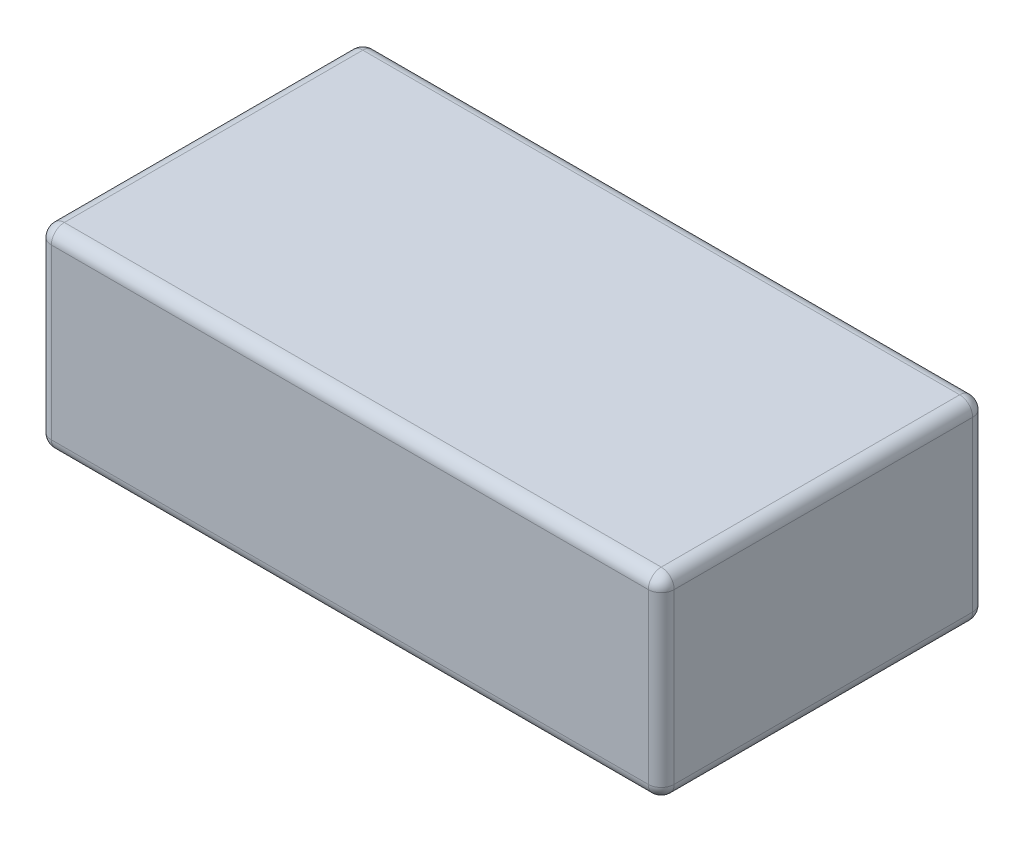
ISO-10303-21;
HEADER;
FILE_DESCRIPTION(('STEP AP214'),'2;1');
FILE_NAME('part.step','',(''),(''),'','','');
FILE_SCHEMA(('AUTOMOTIVE_DESIGN { 1 0 10303 214 1 1 1 1 }'));
ENDSEC;
DATA;
#1=APPLICATION_CONTEXT('core data for automotive mechanical design processes');
#2=APPLICATION_PROTOCOL_DEFINITION('international standard','automotive_design',2000,#1);
#3=PRODUCT_CONTEXT('',#1,'mechanical');
#4=PRODUCT('Part','Part','',(#3));
#5=PRODUCT_RELATED_PRODUCT_CATEGORY('part','',(#4));
#6=PRODUCT_DEFINITION_FORMATION('','',#4);
#7=PRODUCT_DEFINITION_CONTEXT('part definition',#1,'design');
#8=PRODUCT_DEFINITION('design','',#6,#7);
#9=PRODUCT_DEFINITION_SHAPE('','',#8);
#10=(LENGTH_UNIT() NAMED_UNIT(*) SI_UNIT(.MILLI.,.METRE.));
#11=(NAMED_UNIT(*) PLANE_ANGLE_UNIT() SI_UNIT($,.RADIAN.));
#12=(NAMED_UNIT(*) SI_UNIT($,.STERADIAN.) SOLID_ANGLE_UNIT());
#13=UNCERTAINTY_MEASURE_WITH_UNIT(LENGTH_MEASURE(1.E-05),#10,'distance_accuracy_value','');
#14=(GEOMETRIC_REPRESENTATION_CONTEXT(3) GLOBAL_UNCERTAINTY_ASSIGNED_CONTEXT((#13)) GLOBAL_UNIT_ASSIGNED_CONTEXT((#10,
#11,#12)) REPRESENTATION_CONTEXT('',''));
#15=CARTESIAN_POINT('',(0.,0.,0.));
#16=DIRECTION('',(0.,0.,1.));
#17=DIRECTION('',(1.,0.,0.));
#18=AXIS2_PLACEMENT_3D('',#15,#16,#17);
#19=CARTESIAN_POINT('',(24.,15.,12.5));
#20=DIRECTION('',(-1.,0.,0.));
#21=DIRECTION('',(0.,0.,1.));
#22=AXIS2_PLACEMENT_3D('',#19,#20,#21);
#23=PLANE('',#22);
#24=DIRECTION('',(0.,0.,-1.));
#25=VECTOR('',#24,1.);
#26=CARTESIAN_POINT('',(24.,14.,12.5));
#27=LINE('',#26,#25);
#28=CARTESIAN_POINT('',(24.,14.,-11.5));
#29=VERTEX_POINT('',#28);
#30=CARTESIAN_POINT('',(24.,14.,11.5));
#31=VERTEX_POINT('',#30);
#32=EDGE_CURVE('E159',#29,#31,#27,.F.);
#33=ORIENTED_EDGE('',*,*,#32,.T.);
#34=DIRECTION('',(0.,-1.,0.));
#35=VECTOR('',#34,1.);
#36=CARTESIAN_POINT('',(24.,15.,11.5));
#37=LINE('',#36,#35);
#38=CARTESIAN_POINT('',(24.,1.,11.5));
#39=VERTEX_POINT('',#38);
#40=EDGE_CURVE('E162',#31,#39,#37,.T.);
#41=ORIENTED_EDGE('',*,*,#40,.T.);
#42=DIRECTION('',(0.,0.,-1.));
#43=VECTOR('',#42,1.);
#44=CARTESIAN_POINT('',(24.,1.,-12.5));
#45=LINE('',#44,#43);
#46=CARTESIAN_POINT('',(24.,1.,-11.5));
#47=VERTEX_POINT('',#46);
#48=EDGE_CURVE('E136',#39,#47,#45,.T.);
#49=ORIENTED_EDGE('',*,*,#48,.T.);
#50=DIRECTION('',(0.,-1.,0.));
#51=VECTOR('',#50,1.);
#52=CARTESIAN_POINT('',(24.,15.,-11.5));
#53=LINE('',#52,#51);
#54=EDGE_CURVE('E154',#47,#29,#53,.F.);
#55=ORIENTED_EDGE('',*,*,#54,.T.);
#56=EDGE_LOOP('',(#33,#41,#49,#55));
#57=FACE_BOUND('',#56,.T.);
#58=ADVANCED_FACE('F39',(#57),#23,.F.);
#59=CARTESIAN_POINT('',(-24.,15.,-12.5));
#60=DIRECTION('',(0.,0.,1.));
#61=DIRECTION('',(1.,0.,0.));
#62=AXIS2_PLACEMENT_3D('',#59,#60,#61);
#63=PLANE('',#62);
#64=DIRECTION('',(-1.,0.,0.));
#65=VECTOR('',#64,1.);
#66=CARTESIAN_POINT('',(-24.,14.,-12.5));
#67=LINE('',#66,#65);
#68=CARTESIAN_POINT('',(-23.,14.,-12.5));
#69=VERTEX_POINT('',#68);
#70=CARTESIAN_POINT('',(23.,14.,-12.5));
#71=VERTEX_POINT('',#70);
#72=EDGE_CURVE('E177',#69,#71,#67,.F.);
#73=ORIENTED_EDGE('',*,*,#72,.T.);
#74=DIRECTION('',(0.,-1.,0.));
#75=VECTOR('',#74,1.);
#76=CARTESIAN_POINT('',(23.,15.,-12.5));
#77=LINE('',#76,#75);
#78=CARTESIAN_POINT('',(23.,1.,-12.5));
#79=VERTEX_POINT('',#78);
#80=EDGE_CURVE('E182',#71,#79,#77,.T.);
#81=ORIENTED_EDGE('',*,*,#80,.T.);
#82=DIRECTION('',(-1.,0.,0.));
#83=VECTOR('',#82,1.);
#84=CARTESIAN_POINT('',(-24.,1.,-12.5));
#85=LINE('',#84,#83);
#86=CARTESIAN_POINT('',(-23.,1.,-12.5));
#87=VERTEX_POINT('',#86);
#88=EDGE_CURVE('E179',#79,#87,#85,.T.);
#89=ORIENTED_EDGE('',*,*,#88,.T.);
#90=DIRECTION('',(0.,-1.,0.));
#91=VECTOR('',#90,1.);
#92=CARTESIAN_POINT('',(-23.,15.,-12.5));
#93=LINE('',#92,#91);
#94=EDGE_CURVE('E175',#87,#69,#93,.F.);
#95=ORIENTED_EDGE('',*,*,#94,.T.);
#96=EDGE_LOOP('',(#73,#81,#89,#95));
#97=FACE_BOUND('',#96,.T.);
#98=ADVANCED_FACE('F329',(#97),#63,.F.);
#99=CARTESIAN_POINT('',(-24.,15.,12.5));
#100=DIRECTION('',(1.,0.,0.));
#101=DIRECTION('',(0.,0.,-1.));
#102=AXIS2_PLACEMENT_3D('',#99,#100,#101);
#103=PLANE('',#102);
#104=DIRECTION('',(0.,0.,1.));
#105=VECTOR('',#104,1.);
#106=CARTESIAN_POINT('',(-24.,1.,12.5));
#107=LINE('',#106,#105);
#108=CARTESIAN_POINT('',(-24.,1.,-11.5));
#109=VERTEX_POINT('',#108);
#110=CARTESIAN_POINT('',(-24.,1.,11.5));
#111=VERTEX_POINT('',#110);
#112=EDGE_CURVE('E188',#109,#111,#107,.T.);
#113=ORIENTED_EDGE('',*,*,#112,.T.);
#114=DIRECTION('',(0.,-1.,0.));
#115=VECTOR('',#114,1.);
#116=CARTESIAN_POINT('',(-24.,15.,11.5));
#117=LINE('',#116,#115);
#118=CARTESIAN_POINT('',(-24.,14.,11.5));
#119=VERTEX_POINT('',#118);
#120=EDGE_CURVE('E191',#111,#119,#117,.F.);
#121=ORIENTED_EDGE('',*,*,#120,.T.);
#122=DIRECTION('',(0.,0.,1.));
#123=VECTOR('',#122,1.);
#124=CARTESIAN_POINT('',(-24.,14.,12.5));
#125=LINE('',#124,#123);
#126=CARTESIAN_POINT('',(-24.,14.,-11.5));
#127=VERTEX_POINT('',#126);
#128=EDGE_CURVE('E186',#119,#127,#125,.F.);
#129=ORIENTED_EDGE('',*,*,#128,.T.);
#130=DIRECTION('',(0.,-1.,0.));
#131=VECTOR('',#130,1.);
#132=CARTESIAN_POINT('',(-24.,15.,-11.5));
#133=LINE('',#132,#131);
#134=EDGE_CURVE('E184',#127,#109,#133,.T.);
#135=ORIENTED_EDGE('',*,*,#134,.T.);
#136=EDGE_LOOP('',(#113,#121,#129,#135));
#137=FACE_BOUND('',#136,.T.);
#138=ADVANCED_FACE('F299',(#137),#103,.F.);
#139=CARTESIAN_POINT('',(-24.,15.,12.5));
#140=DIRECTION('',(0.,0.,-1.));
#141=DIRECTION('',(-1.,0.,0.));
#142=AXIS2_PLACEMENT_3D('',#139,#140,#141);
#143=PLANE('',#142);
#144=DIRECTION('',(1.,0.,0.));
#145=VECTOR('',#144,1.);
#146=CARTESIAN_POINT('',(24.,1.,12.5));
#147=LINE('',#146,#145);
#148=CARTESIAN_POINT('',(-23.,1.,12.5));
#149=VERTEX_POINT('',#148);
#150=CARTESIAN_POINT('',(23.,1.,12.5));
#151=VERTEX_POINT('',#150);
#152=EDGE_CURVE('E197',#149,#151,#147,.T.);
#153=ORIENTED_EDGE('',*,*,#152,.T.);
#154=DIRECTION('',(0.,-1.,0.));
#155=VECTOR('',#154,1.);
#156=CARTESIAN_POINT('',(23.,15.,12.5));
#157=LINE('',#156,#155);
#158=CARTESIAN_POINT('',(23.,14.,12.5));
#159=VERTEX_POINT('',#158);
#160=EDGE_CURVE('E200',#151,#159,#157,.F.);
#161=ORIENTED_EDGE('',*,*,#160,.T.);
#162=DIRECTION('',(1.,0.,0.));
#163=VECTOR('',#162,1.);
#164=CARTESIAN_POINT('',(-24.,14.,12.5));
#165=LINE('',#164,#163);
#166=CARTESIAN_POINT('',(-23.,14.,12.5));
#167=VERTEX_POINT('',#166);
#168=EDGE_CURVE('E195',#159,#167,#165,.F.);
#169=ORIENTED_EDGE('',*,*,#168,.T.);
#170=DIRECTION('',(0.,-1.,0.));
#171=VECTOR('',#170,1.);
#172=CARTESIAN_POINT('',(-23.,15.,12.5));
#173=LINE('',#172,#171);
#174=EDGE_CURVE('E193',#167,#149,#173,.T.);
#175=ORIENTED_EDGE('',*,*,#174,.T.);
#176=EDGE_LOOP('',(#153,#161,#169,#175));
#177=FACE_BOUND('',#176,.T.);
#178=ADVANCED_FACE('F275',(#177),#143,.F.);
#179=CARTESIAN_POINT('',(0.,15.,0.));
#180=DIRECTION('',(0.,-1.,0.));
#181=DIRECTION('',(0.,0.,-1.));
#182=AXIS2_PLACEMENT_3D('',#179,#180,#181);
#183=PLANE('',#182);
#184=DIRECTION('',(1.,0.,0.));
#185=VECTOR('',#184,1.);
#186=CARTESIAN_POINT('',(0.,15.,11.5));
#187=LINE('',#186,#185);
#188=CARTESIAN_POINT('',(-23.,15.,11.5));
#189=VERTEX_POINT('',#188);
#190=CARTESIAN_POINT('',(23.,15.,11.5));
#191=VERTEX_POINT('',#190);
#192=EDGE_CURVE('E202',#189,#191,#187,.T.);
#193=ORIENTED_EDGE('',*,*,#192,.T.);
#194=DIRECTION('',(0.,0.,-1.));
#195=VECTOR('',#194,1.);
#196=CARTESIAN_POINT('',(23.,15.,0.));
#197=LINE('',#196,#195);
#198=CARTESIAN_POINT('',(23.,15.,-11.5));
#199=VERTEX_POINT('',#198);
#200=EDGE_CURVE('E11',#191,#199,#197,.T.);
#201=ORIENTED_EDGE('',*,*,#200,.T.);
#202=DIRECTION('',(-1.,0.,0.));
#203=VECTOR('',#202,1.);
#204=CARTESIAN_POINT('',(0.,15.,-11.5));
#205=LINE('',#204,#203);
#206=CARTESIAN_POINT('',(-23.,15.,-11.5));
#207=VERTEX_POINT('',#206);
#208=EDGE_CURVE('E48',#199,#207,#205,.T.);
#209=ORIENTED_EDGE('',*,*,#208,.T.);
#210=DIRECTION('',(0.,0.,1.));
#211=VECTOR('',#210,1.);
#212=CARTESIAN_POINT('',(-23.,15.,0.));
#213=LINE('',#212,#211);
#214=EDGE_CURVE('E204',#207,#189,#213,.T.);
#215=ORIENTED_EDGE('',*,*,#214,.T.);
#216=EDGE_LOOP('',(#193,#201,#209,#215));
#217=FACE_BOUND('',#216,.T.);
#218=ADVANCED_FACE('F283',(#217),#183,.F.);
#219=CARTESIAN_POINT('',(0.,0.,0.));
#220=DIRECTION('',(0.,-1.,0.));
#221=DIRECTION('',(0.,0.,-1.));
#222=AXIS2_PLACEMENT_3D('',#219,#220,#221);
#223=PLANE('',#222);
#224=DIRECTION('',(-1.,0.,0.));
#225=VECTOR('',#224,1.);
#226=CARTESIAN_POINT('',(24.,0.,-11.5));
#227=LINE('',#226,#225);
#228=CARTESIAN_POINT('',(-23.,0.,-11.5));
#229=VERTEX_POINT('',#228);
#230=CARTESIAN_POINT('',(23.,0.,-11.5));
#231=VERTEX_POINT('',#230);
#232=EDGE_CURVE('E172',#229,#231,#227,.F.);
#233=ORIENTED_EDGE('',*,*,#232,.T.);
#234=DIRECTION('',(0.,0.,-1.));
#235=VECTOR('',#234,1.);
#236=CARTESIAN_POINT('',(23.,0.,12.5));
#237=LINE('',#236,#235);
#238=CARTESIAN_POINT('',(23.,0.,11.5));
#239=VERTEX_POINT('',#238);
#240=EDGE_CURVE('E138',#231,#239,#237,.F.);
#241=ORIENTED_EDGE('',*,*,#240,.T.);
#242=DIRECTION('',(1.,0.,0.));
#243=VECTOR('',#242,1.);
#244=CARTESIAN_POINT('',(-24.,0.,11.5));
#245=LINE('',#244,#243);
#246=CARTESIAN_POINT('',(-23.,0.,11.5));
#247=VERTEX_POINT('',#246);
#248=EDGE_CURVE('E165',#239,#247,#245,.F.);
#249=ORIENTED_EDGE('',*,*,#248,.T.);
#250=DIRECTION('',(0.,0.,1.));
#251=VECTOR('',#250,1.);
#252=CARTESIAN_POINT('',(-23.,0.,-12.5));
#253=LINE('',#252,#251);
#254=EDGE_CURVE('E170',#247,#229,#253,.F.);
#255=ORIENTED_EDGE('',*,*,#254,.T.);
#256=EDGE_LOOP('',(#233,#241,#249,#255));
#257=FACE_BOUND('',#256,.T.);
#258=ADVANCED_FACE('F362',(#257),#223,.T.);
#259=CARTESIAN_POINT('',(-23.,14.,0.));
#260=DIRECTION('',(0.,0.,1.));
#261=DIRECTION('',(1.,0.,0.));
#262=AXIS2_PLACEMENT_3D('',#259,#260,#261);
#263=CYLINDRICAL_SURFACE('',#262,1.);
#264=CARTESIAN_POINT('',(-23.,14.,11.5));
#265=DIRECTION('',(0.,0.,1.));
#266=DIRECTION('',(1.,0.,0.));
#267=AXIS2_PLACEMENT_3D('',#264,#265,#266);
#268=CIRCLE('',#267,1.);
#269=EDGE_CURVE('E43',#189,#119,#268,.T.);
#270=ORIENTED_EDGE('',*,*,#269,.F.);
#271=ORIENTED_EDGE('',*,*,#214,.F.);
#272=CARTESIAN_POINT('',(-23.,14.,-11.5));
#273=DIRECTION('',(0.,0.,-1.));
#274=DIRECTION('',(-1.,0.,0.));
#275=AXIS2_PLACEMENT_3D('',#272,#273,#274);
#276=CIRCLE('',#275,1.);
#277=EDGE_CURVE('E253',#127,#207,#276,.T.);
#278=ORIENTED_EDGE('',*,*,#277,.F.);
#279=ORIENTED_EDGE('',*,*,#128,.F.);
#280=EDGE_LOOP('',(#270,#271,#278,#279));
#281=FACE_BOUND('',#280,.T.);
#282=ADVANCED_FACE('F41',(#281),#263,.T.);
#283=CARTESIAN_POINT('',(-23.,14.,11.5));
#284=DIRECTION('',(0.,0.,1.));
#285=DIRECTION('',(1.,0.,0.));
#286=AXIS2_PLACEMENT_3D('',#283,#284,#285);
#287=SPHERICAL_SURFACE('',#286,1.);
#288=CARTESIAN_POINT('',(-23.,14.,11.5));
#289=DIRECTION('',(-1.,0.,0.));
#290=DIRECTION('',(0.,0.,1.));
#291=AXIS2_PLACEMENT_3D('',#288,#289,#290);
#292=CIRCLE('',#291,1.);
#293=EDGE_CURVE('E248',#189,#167,#292,.F.);
#294=ORIENTED_EDGE('',*,*,#293,.F.);
#295=ORIENTED_EDGE('',*,*,#269,.T.);
#296=CARTESIAN_POINT('',(-23.,14.,11.5));
#297=DIRECTION('',(0.,1.,0.));
#298=DIRECTION('',(0.,0.,1.));
#299=AXIS2_PLACEMENT_3D('',#296,#297,#298);
#300=CIRCLE('',#299,1.);
#301=EDGE_CURVE('E251',#167,#119,#300,.F.);
#302=ORIENTED_EDGE('',*,*,#301,.F.);
#303=EDGE_LOOP('',(#294,#295,#302));
#304=FACE_BOUND('',#303,.T.);
#305=ADVANCED_FACE('F264',(#304),#287,.T.);
#306=CARTESIAN_POINT('',(-23.,14.,-11.5));
#307=DIRECTION('',(0.,0.,1.));
#308=DIRECTION('',(1.,0.,0.));
#309=AXIS2_PLACEMENT_3D('',#306,#307,#308);
#310=SPHERICAL_SURFACE('',#309,1.);
#311=CARTESIAN_POINT('',(-23.,14.,-11.5));
#312=DIRECTION('',(0.,1.,0.));
#313=DIRECTION('',(0.,0.,1.));
#314=AXIS2_PLACEMENT_3D('',#311,#312,#313);
#315=CIRCLE('',#314,1.);
#316=EDGE_CURVE('E242',#127,#69,#315,.F.);
#317=ORIENTED_EDGE('',*,*,#316,.F.);
#318=ORIENTED_EDGE('',*,*,#277,.T.);
#319=CARTESIAN_POINT('',(-23.,14.,-11.5));
#320=DIRECTION('',(-1.,0.,0.));
#321=DIRECTION('',(0.,0.,1.));
#322=AXIS2_PLACEMENT_3D('',#319,#320,#321);
#323=CIRCLE('',#322,1.);
#324=EDGE_CURVE('E245',#69,#207,#323,.F.);
#325=ORIENTED_EDGE('',*,*,#324,.F.);
#326=EDGE_LOOP('',(#317,#318,#325));
#327=FACE_BOUND('',#326,.T.);
#328=ADVANCED_FACE('F291',(#327),#310,.T.);
#329=CARTESIAN_POINT('',(-23.,15.,11.5));
#330=DIRECTION('',(0.,-1.,0.));
#331=DIRECTION('',(0.,0.,-1.));
#332=AXIS2_PLACEMENT_3D('',#329,#330,#331);
#333=CYLINDRICAL_SURFACE('',#332,1.);
#334=ORIENTED_EDGE('',*,*,#301,.T.);
#335=ORIENTED_EDGE('',*,*,#120,.F.);
#336=CARTESIAN_POINT('',(-23.,1.,11.5));
#337=DIRECTION('',(0.,-1.,0.));
#338=DIRECTION('',(0.,0.,-1.));
#339=AXIS2_PLACEMENT_3D('',#336,#337,#338);
#340=CIRCLE('',#339,1.);
#341=EDGE_CURVE('E237',#149,#111,#340,.T.);
#342=ORIENTED_EDGE('',*,*,#341,.F.);
#343=ORIENTED_EDGE('',*,*,#174,.F.);
#344=EDGE_LOOP('',(#334,#335,#342,#343));
#345=FACE_BOUND('',#344,.T.);
#346=ADVANCED_FACE('F271',(#345),#333,.T.);
#347=CARTESIAN_POINT('',(0.,14.,11.5));
#348=DIRECTION('',(1.,0.,0.));
#349=DIRECTION('',(0.,0.,-1.));
#350=AXIS2_PLACEMENT_3D('',#347,#348,#349);
#351=CYLINDRICAL_SURFACE('',#350,1.);
#352=ORIENTED_EDGE('',*,*,#293,.T.);
#353=ORIENTED_EDGE('',*,*,#168,.F.);
#354=CARTESIAN_POINT('',(23.,14.,11.5));
#355=DIRECTION('',(1.,0.,0.));
#356=DIRECTION('',(0.,0.,-1.));
#357=AXIS2_PLACEMENT_3D('',#354,#355,#356);
#358=CIRCLE('',#357,1.);
#359=EDGE_CURVE('E234',#191,#159,#358,.T.);
#360=ORIENTED_EDGE('',*,*,#359,.F.);
#361=ORIENTED_EDGE('',*,*,#192,.F.);
#362=EDGE_LOOP('',(#352,#353,#360,#361));
#363=FACE_BOUND('',#362,.T.);
#364=ADVANCED_FACE('F281',(#363),#351,.T.);
#365=CARTESIAN_POINT('',(23.,14.,0.));
#366=DIRECTION('',(0.,0.,-1.));
#367=DIRECTION('',(-1.,0.,0.));
#368=AXIS2_PLACEMENT_3D('',#365,#366,#367);
#369=CYLINDRICAL_SURFACE('',#368,1.);
#370=CARTESIAN_POINT('',(23.,14.,-11.5));
#371=DIRECTION('',(0.,0.,-1.));
#372=DIRECTION('',(-1.,0.,0.));
#373=AXIS2_PLACEMENT_3D('',#370,#371,#372);
#374=CIRCLE('',#373,1.);
#375=EDGE_CURVE('E229',#199,#29,#374,.T.);
#376=ORIENTED_EDGE('',*,*,#375,.F.);
#377=ORIENTED_EDGE('',*,*,#200,.F.);
#378=CARTESIAN_POINT('',(23.,14.,11.5));
#379=DIRECTION('',(0.,0.,1.));
#380=DIRECTION('',(1.,0.,0.));
#381=AXIS2_PLACEMENT_3D('',#378,#379,#380);
#382=CIRCLE('',#381,1.);
#383=EDGE_CURVE('E231',#31,#191,#382,.T.);
#384=ORIENTED_EDGE('',*,*,#383,.F.);
#385=ORIENTED_EDGE('',*,*,#32,.F.);
#386=EDGE_LOOP('',(#376,#377,#384,#385));
#387=FACE_BOUND('',#386,.T.);
#388=ADVANCED_FACE('F286',(#387),#369,.T.);
#389=CARTESIAN_POINT('',(0.,14.,-11.5));
#390=DIRECTION('',(-1.,0.,0.));
#391=DIRECTION('',(0.,0.,1.));
#392=AXIS2_PLACEMENT_3D('',#389,#390,#391);
#393=CYLINDRICAL_SURFACE('',#392,1.);
#394=ORIENTED_EDGE('',*,*,#324,.T.);
#395=ORIENTED_EDGE('',*,*,#208,.F.);
#396=CARTESIAN_POINT('',(23.,14.,-11.5));
#397=DIRECTION('',(1.,0.,0.));
#398=DIRECTION('',(0.,0.,-1.));
#399=AXIS2_PLACEMENT_3D('',#396,#397,#398);
#400=CIRCLE('',#399,1.);
#401=EDGE_CURVE('E56',#71,#199,#400,.T.);
#402=ORIENTED_EDGE('',*,*,#401,.F.);
#403=ORIENTED_EDGE('',*,*,#72,.F.);
#404=EDGE_LOOP('',(#394,#395,#402,#403));
#405=FACE_BOUND('',#404,.T.);
#406=ADVANCED_FACE('F289',(#405),#393,.T.);
#407=CARTESIAN_POINT('',(-23.,15.,-11.5));
#408=DIRECTION('',(0.,-1.,0.));
#409=DIRECTION('',(0.,0.,-1.));
#410=AXIS2_PLACEMENT_3D('',#407,#408,#409);
#411=CYLINDRICAL_SURFACE('',#410,1.);
#412=ORIENTED_EDGE('',*,*,#316,.T.);
#413=ORIENTED_EDGE('',*,*,#94,.F.);
#414=CARTESIAN_POINT('',(-23.,1.,-11.5));
#415=DIRECTION('',(0.,-1.,0.));
#416=DIRECTION('',(0.,0.,-1.));
#417=AXIS2_PLACEMENT_3D('',#414,#415,#416);
#418=CIRCLE('',#417,1.);
#419=EDGE_CURVE('E225',#109,#87,#418,.T.);
#420=ORIENTED_EDGE('',*,*,#419,.F.);
#421=ORIENTED_EDGE('',*,*,#134,.F.);
#422=EDGE_LOOP('',(#412,#413,#420,#421));
#423=FACE_BOUND('',#422,.T.);
#424=ADVANCED_FACE('F296',(#423),#411,.T.);
#425=CARTESIAN_POINT('',(-23.,1.,12.5));
#426=DIRECTION('',(0.,0.,-1.));
#427=DIRECTION('',(-1.,0.,0.));
#428=AXIS2_PLACEMENT_3D('',#425,#426,#427);
#429=CYLINDRICAL_SURFACE('',#428,1.);
#430=CARTESIAN_POINT('',(-23.,1.,11.5));
#431=DIRECTION('',(0.,0.,1.));
#432=DIRECTION('',(1.,0.,0.));
#433=AXIS2_PLACEMENT_3D('',#430,#431,#432);
#434=CIRCLE('',#433,1.);
#435=EDGE_CURVE('E239',#111,#247,#434,.T.);
#436=ORIENTED_EDGE('',*,*,#435,.F.);
#437=ORIENTED_EDGE('',*,*,#112,.F.);
#438=CARTESIAN_POINT('',(-23.,1.,-11.5));
#439=DIRECTION('',(0.,0.,-1.));
#440=DIRECTION('',(-1.,0.,0.));
#441=AXIS2_PLACEMENT_3D('',#438,#439,#440);
#442=CIRCLE('',#441,1.);
#443=EDGE_CURVE('E222',#229,#109,#442,.T.);
#444=ORIENTED_EDGE('',*,*,#443,.F.);
#445=ORIENTED_EDGE('',*,*,#254,.F.);
#446=EDGE_LOOP('',(#436,#437,#444,#445));
#447=FACE_BOUND('',#446,.T.);
#448=ADVANCED_FACE('F303',(#447),#429,.T.);
#449=CARTESIAN_POINT('',(-23.,1.,11.5));
#450=DIRECTION('',(0.,0.,1.));
#451=DIRECTION('',(1.,0.,0.));
#452=AXIS2_PLACEMENT_3D('',#449,#450,#451);
#453=SPHERICAL_SURFACE('',#452,1.);
#454=ORIENTED_EDGE('',*,*,#341,.T.);
#455=ORIENTED_EDGE('',*,*,#435,.T.);
#456=CARTESIAN_POINT('',(-23.,1.,11.5));
#457=DIRECTION('',(-1.,0.,0.));
#458=DIRECTION('',(0.,0.,1.));
#459=AXIS2_PLACEMENT_3D('',#456,#457,#458);
#460=CIRCLE('',#459,1.);
#461=EDGE_CURVE('E219',#149,#247,#460,.F.);
#462=ORIENTED_EDGE('',*,*,#461,.F.);
#463=EDGE_LOOP('',(#454,#455,#462));
#464=FACE_BOUND('',#463,.T.);
#465=ADVANCED_FACE('F307',(#464),#453,.T.);
#466=CARTESIAN_POINT('',(23.,14.,11.5));
#467=DIRECTION('',(0.,0.,1.));
#468=DIRECTION('',(1.,0.,0.));
#469=AXIS2_PLACEMENT_3D('',#466,#467,#468);
#470=SPHERICAL_SURFACE('',#469,1.);
#471=ORIENTED_EDGE('',*,*,#383,.T.);
#472=ORIENTED_EDGE('',*,*,#359,.T.);
#473=CARTESIAN_POINT('',(23.,14.,11.5));
#474=DIRECTION('',(0.,1.,0.));
#475=DIRECTION('',(0.,0.,1.));
#476=AXIS2_PLACEMENT_3D('',#473,#474,#475);
#477=CIRCLE('',#476,1.);
#478=EDGE_CURVE('E216',#31,#159,#477,.F.);
#479=ORIENTED_EDGE('',*,*,#478,.F.);
#480=EDGE_LOOP('',(#471,#472,#479));
#481=FACE_BOUND('',#480,.T.);
#482=ADVANCED_FACE('F317',(#481),#470,.T.);
#483=CARTESIAN_POINT('',(23.,14.,-11.5));
#484=DIRECTION('',(0.,0.,1.));
#485=DIRECTION('',(1.,0.,0.));
#486=AXIS2_PLACEMENT_3D('',#483,#484,#485);
#487=SPHERICAL_SURFACE('',#486,1.);
#488=ORIENTED_EDGE('',*,*,#401,.T.);
#489=ORIENTED_EDGE('',*,*,#375,.T.);
#490=CARTESIAN_POINT('',(23.,14.,-11.5));
#491=DIRECTION('',(0.,1.,0.));
#492=DIRECTION('',(0.,0.,1.));
#493=AXIS2_PLACEMENT_3D('',#490,#491,#492);
#494=CIRCLE('',#493,1.);
#495=EDGE_CURVE('E156',#71,#29,#494,.F.);
#496=ORIENTED_EDGE('',*,*,#495,.F.);
#497=EDGE_LOOP('',(#488,#489,#496));
#498=FACE_BOUND('',#497,.T.);
#499=ADVANCED_FACE('F319',(#498),#487,.T.);
#500=CARTESIAN_POINT('',(-23.,1.,-11.5));
#501=DIRECTION('',(0.,0.,1.));
#502=DIRECTION('',(1.,0.,0.));
#503=AXIS2_PLACEMENT_3D('',#500,#501,#502);
#504=SPHERICAL_SURFACE('',#503,1.);
#505=ORIENTED_EDGE('',*,*,#443,.T.);
#506=ORIENTED_EDGE('',*,*,#419,.T.);
#507=CARTESIAN_POINT('',(-23.,1.,-11.5));
#508=DIRECTION('',(-1.,0.,0.));
#509=DIRECTION('',(0.,0.,1.));
#510=AXIS2_PLACEMENT_3D('',#507,#508,#509);
#511=CIRCLE('',#510,1.);
#512=EDGE_CURVE('E213',#229,#87,#511,.F.);
#513=ORIENTED_EDGE('',*,*,#512,.F.);
#514=EDGE_LOOP('',(#505,#506,#513));
#515=FACE_BOUND('',#514,.T.);
#516=ADVANCED_FACE('F325',(#515),#504,.T.);
#517=CARTESIAN_POINT('',(-24.,1.,11.5));
#518=DIRECTION('',(-1.,0.,0.));
#519=DIRECTION('',(0.,0.,1.));
#520=AXIS2_PLACEMENT_3D('',#517,#518,#519);
#521=CYLINDRICAL_SURFACE('',#520,1.);
#522=ORIENTED_EDGE('',*,*,#461,.T.);
#523=ORIENTED_EDGE('',*,*,#248,.F.);
#524=CARTESIAN_POINT('',(23.,1.,11.5));
#525=DIRECTION('',(1.,0.,0.));
#526=DIRECTION('',(0.,0.,-1.));
#527=AXIS2_PLACEMENT_3D('',#524,#525,#526);
#528=CIRCLE('',#527,1.);
#529=EDGE_CURVE('E210',#151,#239,#528,.T.);
#530=ORIENTED_EDGE('',*,*,#529,.F.);
#531=ORIENTED_EDGE('',*,*,#152,.F.);
#532=EDGE_LOOP('',(#522,#523,#530,#531));
#533=FACE_BOUND('',#532,.T.);
#534=ADVANCED_FACE('F310',(#533),#521,.T.);
#535=CARTESIAN_POINT('',(23.,15.,11.5));
#536=DIRECTION('',(0.,-1.,0.));
#537=DIRECTION('',(0.,0.,-1.));
#538=AXIS2_PLACEMENT_3D('',#535,#536,#537);
#539=CYLINDRICAL_SURFACE('',#538,1.);
#540=ORIENTED_EDGE('',*,*,#478,.T.);
#541=ORIENTED_EDGE('',*,*,#160,.F.);
#542=CARTESIAN_POINT('',(23.,1.,11.5));
#543=DIRECTION('',(0.,-1.,0.));
#544=DIRECTION('',(0.,0.,-1.));
#545=AXIS2_PLACEMENT_3D('',#542,#543,#544);
#546=CIRCLE('',#545,1.);
#547=EDGE_CURVE('E151',#39,#151,#546,.T.);
#548=ORIENTED_EDGE('',*,*,#547,.F.);
#549=ORIENTED_EDGE('',*,*,#40,.F.);
#550=EDGE_LOOP('',(#540,#541,#548,#549));
#551=FACE_BOUND('',#550,.T.);
#552=ADVANCED_FACE('F315',(#551),#539,.T.);
#553=CARTESIAN_POINT('',(23.,15.,-11.5));
#554=DIRECTION('',(0.,-1.,0.));
#555=DIRECTION('',(0.,0.,-1.));
#556=AXIS2_PLACEMENT_3D('',#553,#554,#555);
#557=CYLINDRICAL_SURFACE('',#556,1.);
#558=ORIENTED_EDGE('',*,*,#495,.T.);
#559=ORIENTED_EDGE('',*,*,#54,.F.);
#560=CARTESIAN_POINT('',(23.,1.,-11.5));
#561=DIRECTION('',(0.,-1.,0.));
#562=DIRECTION('',(0.,0.,-1.));
#563=AXIS2_PLACEMENT_3D('',#560,#561,#562);
#564=CIRCLE('',#563,1.);
#565=EDGE_CURVE('E144',#79,#47,#564,.T.);
#566=ORIENTED_EDGE('',*,*,#565,.F.);
#567=ORIENTED_EDGE('',*,*,#80,.F.);
#568=EDGE_LOOP('',(#558,#559,#566,#567));
#569=FACE_BOUND('',#568,.T.);
#570=ADVANCED_FACE('F155',(#569),#557,.T.);
#571=CARTESIAN_POINT('',(-24.,1.,-11.5));
#572=DIRECTION('',(1.,0.,0.));
#573=DIRECTION('',(0.,0.,-1.));
#574=AXIS2_PLACEMENT_3D('',#571,#572,#573);
#575=CYLINDRICAL_SURFACE('',#574,1.);
#576=ORIENTED_EDGE('',*,*,#512,.T.);
#577=ORIENTED_EDGE('',*,*,#88,.F.);
#578=CARTESIAN_POINT('',(23.,1.,-11.5));
#579=DIRECTION('',(1.,0.,0.));
#580=DIRECTION('',(0.,0.,-1.));
#581=AXIS2_PLACEMENT_3D('',#578,#579,#580);
#582=CIRCLE('',#581,1.);
#583=EDGE_CURVE('E148',#231,#79,#582,.T.);
#584=ORIENTED_EDGE('',*,*,#583,.F.);
#585=ORIENTED_EDGE('',*,*,#232,.F.);
#586=EDGE_LOOP('',(#576,#577,#584,#585));
#587=FACE_BOUND('',#586,.T.);
#588=ADVANCED_FACE('F345',(#587),#575,.T.);
#589=CARTESIAN_POINT('',(23.,1.,11.5));
#590=DIRECTION('',(0.,0.,1.));
#591=DIRECTION('',(1.,0.,0.));
#592=AXIS2_PLACEMENT_3D('',#589,#590,#591);
#593=SPHERICAL_SURFACE('',#592,1.);
#594=ORIENTED_EDGE('',*,*,#547,.T.);
#595=ORIENTED_EDGE('',*,*,#529,.T.);
#596=CARTESIAN_POINT('',(23.,1.,11.5));
#597=DIRECTION('',(0.,0.,1.));
#598=DIRECTION('',(1.,0.,0.));
#599=AXIS2_PLACEMENT_3D('',#596,#597,#598);
#600=CIRCLE('',#599,1.);
#601=EDGE_CURVE('E141',#39,#239,#600,.F.);
#602=ORIENTED_EDGE('',*,*,#601,.F.);
#603=EDGE_LOOP('',(#594,#595,#602));
#604=FACE_BOUND('',#603,.T.);
#605=ADVANCED_FACE('F342',(#604),#593,.T.);
#606=CARTESIAN_POINT('',(23.,1.,-11.5));
#607=DIRECTION('',(0.,0.,1.));
#608=DIRECTION('',(1.,0.,0.));
#609=AXIS2_PLACEMENT_3D('',#606,#607,#608);
#610=SPHERICAL_SURFACE('',#609,1.);
#611=ORIENTED_EDGE('',*,*,#583,.T.);
#612=ORIENTED_EDGE('',*,*,#565,.T.);
#613=CARTESIAN_POINT('',(23.,1.,-11.5));
#614=DIRECTION('',(0.,0.,-1.));
#615=DIRECTION('',(-1.,0.,0.));
#616=AXIS2_PLACEMENT_3D('',#613,#614,#615);
#617=CIRCLE('',#616,1.);
#618=EDGE_CURVE('E132',#231,#47,#617,.F.);
#619=ORIENTED_EDGE('',*,*,#618,.F.);
#620=EDGE_LOOP('',(#611,#612,#619));
#621=FACE_BOUND('',#620,.T.);
#622=ADVANCED_FACE('F146',(#621),#610,.T.);
#623=CARTESIAN_POINT('',(23.,1.,12.5));
#624=DIRECTION('',(0.,0.,1.));
#625=DIRECTION('',(1.,0.,0.));
#626=AXIS2_PLACEMENT_3D('',#623,#624,#625);
#627=CYLINDRICAL_SURFACE('',#626,1.);
#628=ORIENTED_EDGE('',*,*,#601,.T.);
#629=ORIENTED_EDGE('',*,*,#240,.F.);
#630=ORIENTED_EDGE('',*,*,#618,.T.);
#631=ORIENTED_EDGE('',*,*,#48,.F.);
#632=EDGE_LOOP('',(#628,#629,#630,#631));
#633=FACE_BOUND('',#632,.T.);
#634=ADVANCED_FACE('F134',(#633),#627,.T.);
#635=CLOSED_SHELL('',(#58,#98,#138,#178,#218,#258,#282,#305,#328,#346,#364,#388,#406,#424,#448,
#465,#482,#499,#516,#534,#552,#570,#588,#605,#622,#634));
#636=MANIFOLD_SOLID_BREP('B2',#635);
#637=ADVANCED_BREP_SHAPE_REPRESENTATION('',(#18,#636),#14);
#638=SHAPE_DEFINITION_REPRESENTATION(#9,#637);
ENDSEC;
END-ISO-10303-21;
